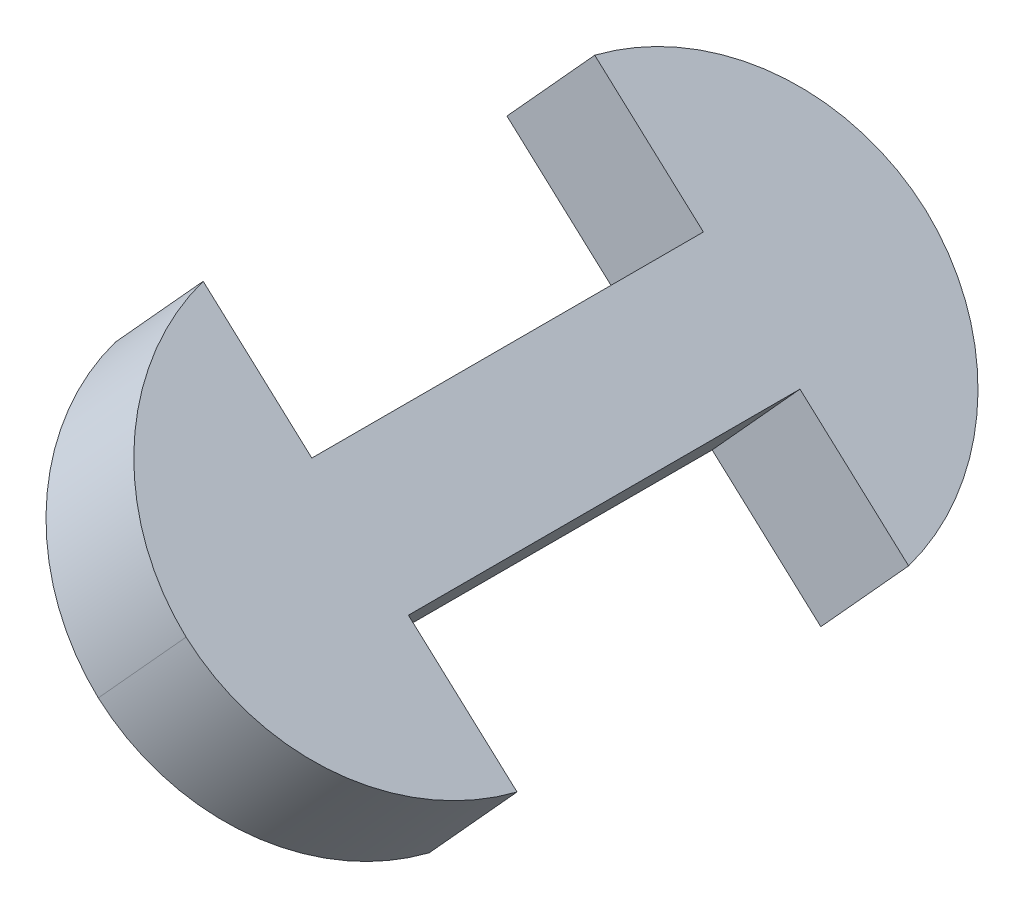
ISO-10303-21;
HEADER;
FILE_DESCRIPTION(('STEP AP214'),'2;1');
FILE_NAME('part.step','',(''),(''),'','','');
FILE_SCHEMA(('AUTOMOTIVE_DESIGN { 1 0 10303 214 1 1 1 1 }'));
ENDSEC;
DATA;
#1=APPLICATION_CONTEXT('core data for automotive mechanical design processes');
#2=APPLICATION_PROTOCOL_DEFINITION('international standard','automotive_design',2000,#1);
#3=PRODUCT_CONTEXT('',#1,'mechanical');
#4=PRODUCT('Part','Part','',(#3));
#5=PRODUCT_RELATED_PRODUCT_CATEGORY('part','',(#4));
#6=PRODUCT_DEFINITION_FORMATION('','',#4);
#7=PRODUCT_DEFINITION_CONTEXT('part definition',#1,'design');
#8=PRODUCT_DEFINITION('design','',#6,#7);
#9=PRODUCT_DEFINITION_SHAPE('','',#8);
#10=(LENGTH_UNIT() NAMED_UNIT(*) SI_UNIT(.MILLI.,.METRE.));
#11=(NAMED_UNIT(*) PLANE_ANGLE_UNIT() SI_UNIT($,.RADIAN.));
#12=(NAMED_UNIT(*) SI_UNIT($,.STERADIAN.) SOLID_ANGLE_UNIT());
#13=UNCERTAINTY_MEASURE_WITH_UNIT(LENGTH_MEASURE(1.E-05),#10,'distance_accuracy_value','');
#14=(GEOMETRIC_REPRESENTATION_CONTEXT(3) GLOBAL_UNCERTAINTY_ASSIGNED_CONTEXT((#13)) GLOBAL_UNIT_ASSIGNED_CONTEXT((#10,
#11,#12)) REPRESENTATION_CONTEXT('',''));
#15=CARTESIAN_POINT('',(0.,0.,0.));
#16=DIRECTION('',(0.,0.,1.));
#17=DIRECTION('',(1.,0.,0.));
#18=AXIS2_PLACEMENT_3D('',#15,#16,#17);
#19=CARTESIAN_POINT('',(0.,0.,0.));
#20=DIRECTION('',(0.,0.,1.));
#21=DIRECTION('',(1.,0.,0.));
#22=AXIS2_PLACEMENT_3D('',#19,#20,#21);
#23=PLANE('',#22);
#24=DIRECTION('',(0.672672793996317,0.73994007339594,0.));
#25=VECTOR('',#24,1.);
#26=CARTESIAN_POINT('',(-146.214037267714,11.5216889926446,0.));
#27=LINE('',#26,#25);
#28=CARTESIAN_POINT('',(-150.250074031691,7.08204855226896,0.));
#29=VERTEX_POINT('',#28);
#30=CARTESIAN_POINT('',(-146.214037267714,11.5216889926446,0.));
#31=VERTEX_POINT('',#30);
#32=EDGE_CURVE('E50',#29,#31,#27,.T.);
#33=ORIENTED_EDGE('',*,*,#32,.F.);
#34=DIRECTION('',(0.739940073395943,-0.672672793996314,0.));
#35=VECTOR('',#34,1.);
#36=CARTESIAN_POINT('',(-155.244669527114,11.6225899117438,0.));
#37=LINE('',#36,#35);
#38=CARTESIAN_POINT('',(-155.244669527114,11.6225899117438,0.));
#39=VERTEX_POINT('',#38);
#40=EDGE_CURVE('E225',#39,#29,#37,.T.);
#41=ORIENTED_EDGE('',*,*,#40,.F.);
#42=DIRECTION('',(-0.672672793996313,-0.739940073395943,0.));
#43=VECTOR('',#42,1.);
#44=CARTESIAN_POINT('',(-151.208632763136,16.0622303521195,0.));
#45=LINE('',#44,#43);
#46=CARTESIAN_POINT('',(-151.208632763136,16.0622303521195,0.));
#47=VERTEX_POINT('',#46);
#48=EDGE_CURVE('E211',#47,#39,#45,.T.);
#49=ORIENTED_EDGE('',*,*,#48,.F.);
#50=DIRECTION('',(-0.739940073395943,0.672672793996314,0.));
#51=VECTOR('',#50,1.);
#52=CARTESIAN_POINT('',(-136.779801331915,2.94511086919134,0.));
#53=LINE('',#52,#51);
#54=EDGE_CURVE('E55',#31,#47,#53,.T.);
#55=ORIENTED_EDGE('',*,*,#54,.F.);
#56=EDGE_LOOP('',(#33,#41,#49,#55));
#57=FACE_BOUND('',#56,.T.);
#58=ADVANCED_FACE('F33',(#57),#23,.F.);
#59=DIRECTION('',(-0.672672793996314,-0.739940073395942,0.));
#60=VECTOR('',#59,1.);
#61=CARTESIAN_POINT('',(-145.810433591316,3.04601178829107,0.));
#62=LINE('',#61,#60);
#63=CARTESIAN_POINT('',(-141.774396827338,7.48565222866671,0.));
#64=VERTEX_POINT('',#63);
#65=CARTESIAN_POINT('',(-145.810433591316,3.04601178829107,0.));
#66=VERTEX_POINT('',#65);
#67=EDGE_CURVE('E117',#64,#66,#62,.T.);
#68=ORIENTED_EDGE('',*,*,#67,.F.);
#69=CARTESIAN_POINT('',(-136.779801331915,2.94511086919134,0.));
#70=VERTEX_POINT('',#69);
#71=EDGE_CURVE('E194',#70,#64,#53,.T.);
#72=ORIENTED_EDGE('',*,*,#71,.F.);
#73=DIRECTION('',(0.672672793996318,0.739940073395939,0.));
#74=VECTOR('',#73,1.);
#75=CARTESIAN_POINT('',(-140.815838095893,-1.49452957118428,0.));
#76=LINE('',#75,#74);
#77=CARTESIAN_POINT('',(-140.815838095893,-1.49452957118428,0.));
#78=VERTEX_POINT('',#77);
#79=EDGE_CURVE('E223',#78,#70,#76,.T.);
#80=ORIENTED_EDGE('',*,*,#79,.F.);
#81=EDGE_CURVE('E229',#66,#78,#37,.T.);
#82=ORIENTED_EDGE('',*,*,#81,.F.);
#83=EDGE_LOOP('',(#68,#72,#80,#82));
#84=FACE_BOUND('',#83,.T.);
#85=ADVANCED_FACE('F238',(#84),#23,.F.);
#86=CARTESIAN_POINT('',(-136.779801331915,2.94511086919134,8.));
#87=DIRECTION('',(-0.672672793996313,-0.739940073395943,0.));
#88=DIRECTION('',(0.739940073395943,-0.672672793996314,0.));
#89=AXIS2_PLACEMENT_3D('',#86,#87,#88);
#90=PLANE('',#89);
#91=ORIENTED_EDGE('',*,*,#71,.T.);
#92=DIRECTION('',(0.,0.,1.));
#93=VECTOR('',#92,1.);
#94=CARTESIAN_POINT('',(-141.774396827338,7.48565222866671,-9.));
#95=LINE('',#94,#93);
#96=CARTESIAN_POINT('',(-141.774396827338,7.48565222866671,-18.));
#97=VERTEX_POINT('',#96);
#98=EDGE_CURVE('E119',#97,#64,#95,.T.);
#99=ORIENTED_EDGE('',*,*,#98,.F.);
#100=DIRECTION('',(-0.739940073395943,0.672672793996314,0.));
#101=VECTOR('',#100,1.);
#102=CARTESIAN_POINT('',(-136.779801331915,2.94511086919134,-18.));
#103=LINE('',#102,#101);
#104=CARTESIAN_POINT('',(-136.779801331915,2.94511086919134,-18.));
#105=VERTEX_POINT('',#104);
#106=EDGE_CURVE('E137',#105,#97,#103,.T.);
#107=ORIENTED_EDGE('',*,*,#106,.F.);
#108=CARTESIAN_POINT('',(-144.029703812145,9.53593130576443,-16.));
#109=DIRECTION('',(0.672672793996313,0.739940073395943,0.));
#110=DIRECTION('',(0.739940073395943,-0.672672793996314,0.));
#111=AXIS2_PLACEMENT_3D('',#108,#109,#110);
#112=CIRCLE('',#111,10.);
#113=CARTESIAN_POINT('',(-143.994217047526,9.5036706106554,-25.9998849961931));
#114=VERTEX_POINT('',#113);
#115=EDGE_CURVE('E162',#114,#105,#112,.F.);
#116=ORIENTED_EDGE('',*,*,#115,.F.);
#117=CARTESIAN_POINT('',(-143.958730282906,9.47140991554638,-16.));
#118=DIRECTION('',(0.672672793996313,0.739940073395943,0.));
#119=DIRECTION('',(0.739940073395943,-0.672672793996314,0.));
#120=AXIS2_PLACEMENT_3D('',#117,#118,#119);
#121=CIRCLE('',#120,10.);
#122=CARTESIAN_POINT('',(-151.208632763136,16.0622303521195,-18.));
#123=VERTEX_POINT('',#122);
#124=EDGE_CURVE('E159',#123,#114,#121,.F.);
#125=ORIENTED_EDGE('',*,*,#124,.F.);
#126=CARTESIAN_POINT('',(-146.214037267714,11.5216889926446,-18.));
#127=VERTEX_POINT('',#126);
#128=EDGE_CURVE('E155',#127,#123,#103,.T.);
#129=ORIENTED_EDGE('',*,*,#128,.F.);
#130=DIRECTION('',(0.,0.,1.));
#131=VECTOR('',#130,1.);
#132=CARTESIAN_POINT('',(-146.214037267714,11.5216889926446,-9.));
#133=LINE('',#132,#131);
#134=EDGE_CURVE('E182',#127,#31,#133,.T.);
#135=ORIENTED_EDGE('',*,*,#134,.T.);
#136=ORIENTED_EDGE('',*,*,#54,.T.);
#137=CARTESIAN_POINT('',(-143.958730282906,9.47140991554638,-2.));
#138=DIRECTION('',(-0.672672793996313,-0.739940073395943,0.));
#139=DIRECTION('',(0.739940073395943,-0.672672793996314,0.));
#140=AXIS2_PLACEMENT_3D('',#137,#138,#139);
#141=CIRCLE('',#140,10.);
#142=CARTESIAN_POINT('',(-143.994217047526,9.5036706106554,7.9998849961931));
#143=VERTEX_POINT('',#142);
#144=EDGE_CURVE('E11',#47,#143,#141,.F.);
#145=ORIENTED_EDGE('',*,*,#144,.T.);
#146=CARTESIAN_POINT('',(-144.029703812145,9.53593130576443,-2.));
#147=DIRECTION('',(-0.672672793996313,-0.739940073395943,0.));
#148=DIRECTION('',(0.739940073395943,-0.672672793996314,0.));
#149=AXIS2_PLACEMENT_3D('',#146,#147,#148);
#150=CIRCLE('',#149,10.);
#151=EDGE_CURVE('E42',#143,#70,#150,.F.);
#152=ORIENTED_EDGE('',*,*,#151,.T.);
#153=EDGE_LOOP('',(#91,#99,#107,#116,#125,#129,#135,#136,#145,#152));
#154=FACE_BOUND('',#153,.T.);
#155=ADVANCED_FACE('F187',(#154),#90,.F.);
#156=CARTESIAN_POINT('',(-155.244669527114,11.6225899117438,8.));
#157=DIRECTION('',(0.672672793996314,0.739940073395943,0.));
#158=DIRECTION('',(-0.739940073395943,0.672672793996314,0.));
#159=AXIS2_PLACEMENT_3D('',#156,#157,#158);
#160=PLANE('',#159);
#161=CARTESIAN_POINT('',(-148.065740576123,5.0962908653888,-2.));
#162=DIRECTION('',(0.672672793996314,0.739940073395943,0.));
#163=DIRECTION('',(-0.739940073395943,0.672672793996314,0.));
#164=AXIS2_PLACEMENT_3D('',#161,#162,#163);
#165=CIRCLE('',#164,10.);
#166=CARTESIAN_POINT('',(-148.030253811503,5.06403017027976,7.9998849961931));
#167=VERTEX_POINT('',#166);
#168=EDGE_CURVE('E221',#78,#167,#165,.F.);
#169=ORIENTED_EDGE('',*,*,#168,.T.);
#170=CARTESIAN_POINT('',(-147.994767046883,5.03176947517072,-2.));
#171=DIRECTION('',(0.672672793996314,0.739940073395943,0.));
#172=DIRECTION('',(-0.739940073395943,0.672672793996314,0.));
#173=AXIS2_PLACEMENT_3D('',#170,#171,#172);
#174=CIRCLE('',#173,10.);
#175=EDGE_CURVE('E219',#167,#39,#174,.F.);
#176=ORIENTED_EDGE('',*,*,#175,.T.);
#177=ORIENTED_EDGE('',*,*,#40,.T.);
#178=DIRECTION('',(0.,0.,1.));
#179=VECTOR('',#178,1.);
#180=CARTESIAN_POINT('',(-150.250074031691,7.08204855226896,-9.));
#181=LINE('',#180,#179);
#182=CARTESIAN_POINT('',(-150.250074031691,7.08204855226896,-18.));
#183=VERTEX_POINT('',#182);
#184=EDGE_CURVE('E120',#183,#29,#181,.T.);
#185=ORIENTED_EDGE('',*,*,#184,.F.);
#186=DIRECTION('',(0.739940073395943,-0.672672793996314,0.));
#187=VECTOR('',#186,1.);
#188=CARTESIAN_POINT('',(-155.244669527114,11.6225899117438,-18.));
#189=LINE('',#188,#187);
#190=CARTESIAN_POINT('',(-155.244669527114,11.6225899117438,-18.));
#191=VERTEX_POINT('',#190);
#192=EDGE_CURVE('E131',#191,#183,#189,.T.);
#193=ORIENTED_EDGE('',*,*,#192,.F.);
#194=CARTESIAN_POINT('',(-147.994767046883,5.03176947517072,-16.));
#195=DIRECTION('',(-0.672672793996314,-0.739940073395943,0.));
#196=DIRECTION('',(-0.739940073395943,0.672672793996314,0.));
#197=AXIS2_PLACEMENT_3D('',#194,#195,#196);
#198=CIRCLE('',#197,10.);
#199=CARTESIAN_POINT('',(-148.030253811503,5.06403017027976,-25.9998849961931));
#200=VERTEX_POINT('',#199);
#201=EDGE_CURVE('E164',#200,#191,#198,.F.);
#202=ORIENTED_EDGE('',*,*,#201,.F.);
#203=CARTESIAN_POINT('',(-148.065740576123,5.0962908653888,-16.));
#204=DIRECTION('',(-0.672672793996314,-0.739940073395943,0.));
#205=DIRECTION('',(-0.739940073395943,0.672672793996314,0.));
#206=AXIS2_PLACEMENT_3D('',#203,#204,#205);
#207=CIRCLE('',#206,10.);
#208=CARTESIAN_POINT('',(-140.815838095893,-1.49452957118428,-18.));
#209=VERTEX_POINT('',#208);
#210=EDGE_CURVE('E127',#209,#200,#207,.F.);
#211=ORIENTED_EDGE('',*,*,#210,.F.);
#212=CARTESIAN_POINT('',(-145.810433591316,3.04601178829107,-18.));
#213=VERTEX_POINT('',#212);
#214=EDGE_CURVE('E123',#213,#209,#189,.T.);
#215=ORIENTED_EDGE('',*,*,#214,.F.);
#216=DIRECTION('',(0.,0.,1.));
#217=VECTOR('',#216,1.);
#218=CARTESIAN_POINT('',(-145.810433591316,3.04601178829107,-9.));
#219=LINE('',#218,#217);
#220=EDGE_CURVE('E111',#213,#66,#219,.T.);
#221=ORIENTED_EDGE('',*,*,#220,.T.);
#222=ORIENTED_EDGE('',*,*,#81,.T.);
#223=EDGE_LOOP('',(#169,#176,#177,#185,#193,#202,#211,#215,#221,#222));
#224=FACE_BOUND('',#223,.T.);
#225=ADVANCED_FACE('F124',(#224),#160,.F.);
#226=CARTESIAN_POINT('',(-148.065740576123,5.09629086538885,-2.));
#227=DIRECTION('',(0.672672793996318,0.739940073395939,0.));
#228=DIRECTION('',(-0.739940073395939,0.672672793996318,0.));
#229=AXIS2_PLACEMENT_3D('',#226,#227,#228);
#230=CYLINDRICAL_SURFACE('',#229,10.);
#231=ORIENTED_EDGE('',*,*,#79,.T.);
#232=ORIENTED_EDGE('',*,*,#151,.F.);
#233=DIRECTION('',(0.672672793996318,0.739940073395939,0.));
#234=VECTOR('',#233,1.);
#235=CARTESIAN_POINT('',(-146.012235429514,7.28385039046759,7.9998849961931));
#236=LINE('',#235,#234);
#237=EDGE_CURVE('E195',#167,#143,#236,.T.);
#238=ORIENTED_EDGE('',*,*,#237,.F.);
#239=ORIENTED_EDGE('',*,*,#168,.F.);
#240=EDGE_LOOP('',(#231,#232,#238,#239));
#241=FACE_BOUND('',#240,.T.);
#242=ADVANCED_FACE('F35',(#241),#230,.T.);
#243=CARTESIAN_POINT('',(-143.958730282906,9.47140991554638,-2.));
#244=DIRECTION('',(-0.672672793996313,-0.739940073395943,0.));
#245=DIRECTION('',(0.739940073395943,-0.672672793996313,0.));
#246=AXIS2_PLACEMENT_3D('',#243,#244,#245);
#247=CYLINDRICAL_SURFACE('',#246,10.);
#248=ORIENTED_EDGE('',*,*,#144,.F.);
#249=ORIENTED_EDGE('',*,*,#48,.T.);
#250=ORIENTED_EDGE('',*,*,#175,.F.);
#251=ORIENTED_EDGE('',*,*,#237,.T.);
#252=EDGE_LOOP('',(#248,#249,#250,#251));
#253=FACE_BOUND('',#252,.T.);
#254=ADVANCED_FACE('F236',(#253),#247,.T.);
#255=CARTESIAN_POINT('',(-145.810433591316,3.04601178829107,-9.));
#256=DIRECTION('',(-0.739940073395942,0.672672793996314,0.));
#257=DIRECTION('',(-0.672672793996314,-0.739940073395942,0.));
#258=AXIS2_PLACEMENT_3D('',#255,#256,#257);
#259=PLANE('',#258);
#260=ORIENTED_EDGE('',*,*,#67,.T.);
#261=ORIENTED_EDGE('',*,*,#220,.F.);
#262=DIRECTION('',(-0.672672793996314,-0.739940073395942,0.));
#263=VECTOR('',#262,1.);
#264=CARTESIAN_POINT('',(-145.810433591316,3.04601178829107,-18.));
#265=LINE('',#264,#263);
#266=EDGE_CURVE('E116',#97,#213,#265,.T.);
#267=ORIENTED_EDGE('',*,*,#266,.F.);
#268=ORIENTED_EDGE('',*,*,#98,.T.);
#269=EDGE_LOOP('',(#260,#261,#267,#268));
#270=FACE_BOUND('',#269,.T.);
#271=ADVANCED_FACE('F113',(#270),#259,.F.);
#272=CARTESIAN_POINT('',(-146.214037267714,11.5216889926446,-9.));
#273=DIRECTION('',(0.73994007339594,-0.672672793996317,0.));
#274=DIRECTION('',(0.672672793996317,0.73994007339594,0.));
#275=AXIS2_PLACEMENT_3D('',#272,#273,#274);
#276=PLANE('',#275);
#277=ORIENTED_EDGE('',*,*,#32,.T.);
#278=ORIENTED_EDGE('',*,*,#134,.F.);
#279=DIRECTION('',(0.672672793996317,0.73994007339594,0.));
#280=VECTOR('',#279,1.);
#281=CARTESIAN_POINT('',(-146.214037267714,11.5216889926446,-18.));
#282=LINE('',#281,#280);
#283=EDGE_CURVE('E138',#183,#127,#282,.T.);
#284=ORIENTED_EDGE('',*,*,#283,.F.);
#285=ORIENTED_EDGE('',*,*,#184,.T.);
#286=EDGE_LOOP('',(#277,#278,#284,#285));
#287=FACE_BOUND('',#286,.T.);
#288=ADVANCED_FACE('F180',(#287),#276,.F.);
#289=CARTESIAN_POINT('',(0.,0.,-18.));
#290=DIRECTION('',(0.,0.,-1.));
#291=DIRECTION('',(1.,0.,0.));
#292=AXIS2_PLACEMENT_3D('',#289,#290,#291);
#293=PLANE('',#292);
#294=ORIENTED_EDGE('',*,*,#283,.T.);
#295=ORIENTED_EDGE('',*,*,#128,.T.);
#296=DIRECTION('',(-0.672672793996313,-0.739940073395943,0.));
#297=VECTOR('',#296,1.);
#298=CARTESIAN_POINT('',(-151.208632763136,16.0622303521195,-18.));
#299=LINE('',#298,#297);
#300=EDGE_CURVE('E132',#123,#191,#299,.T.);
#301=ORIENTED_EDGE('',*,*,#300,.T.);
#302=ORIENTED_EDGE('',*,*,#192,.T.);
#303=EDGE_LOOP('',(#294,#295,#301,#302));
#304=FACE_BOUND('',#303,.T.);
#305=ADVANCED_FACE('F175',(#304),#293,.F.);
#306=ORIENTED_EDGE('',*,*,#266,.T.);
#307=ORIENTED_EDGE('',*,*,#214,.T.);
#308=DIRECTION('',(0.672672793996318,0.739940073395939,0.));
#309=VECTOR('',#308,1.);
#310=CARTESIAN_POINT('',(-140.815838095893,-1.49452957118428,-18.));
#311=LINE('',#310,#309);
#312=EDGE_CURVE('E167',#209,#105,#311,.T.);
#313=ORIENTED_EDGE('',*,*,#312,.T.);
#314=ORIENTED_EDGE('',*,*,#106,.T.);
#315=EDGE_LOOP('',(#306,#307,#313,#314));
#316=FACE_BOUND('',#315,.T.);
#317=ADVANCED_FACE('F135',(#316),#293,.F.);
#318=CARTESIAN_POINT('',(-148.065740576123,5.09629086538885,-16.));
#319=DIRECTION('',(0.672672793996318,0.739940073395939,0.));
#320=DIRECTION('',(-0.739940073395939,0.672672793996318,0.));
#321=AXIS2_PLACEMENT_3D('',#318,#319,#320);
#322=CYLINDRICAL_SURFACE('',#321,10.);
#323=ORIENTED_EDGE('',*,*,#312,.F.);
#324=ORIENTED_EDGE('',*,*,#210,.T.);
#325=DIRECTION('',(0.672672793996318,0.739940073395939,0.));
#326=VECTOR('',#325,1.);
#327=CARTESIAN_POINT('',(-146.012235429514,7.28385039046759,-25.9998849961931));
#328=LINE('',#327,#326);
#329=EDGE_CURVE('E141',#200,#114,#328,.T.);
#330=ORIENTED_EDGE('',*,*,#329,.T.);
#331=ORIENTED_EDGE('',*,*,#115,.T.);
#332=EDGE_LOOP('',(#323,#324,#330,#331));
#333=FACE_BOUND('',#332,.T.);
#334=ADVANCED_FACE('F192',(#333),#322,.T.);
#335=CARTESIAN_POINT('',(-143.958730282906,9.47140991554638,-16.));
#336=DIRECTION('',(-0.672672793996313,-0.739940073395943,0.));
#337=DIRECTION('',(0.739940073395943,-0.672672793996313,0.));
#338=AXIS2_PLACEMENT_3D('',#335,#336,#337);
#339=CYLINDRICAL_SURFACE('',#338,10.);
#340=ORIENTED_EDGE('',*,*,#124,.T.);
#341=ORIENTED_EDGE('',*,*,#329,.F.);
#342=ORIENTED_EDGE('',*,*,#201,.T.);
#343=ORIENTED_EDGE('',*,*,#300,.F.);
#344=EDGE_LOOP('',(#340,#341,#342,#343));
#345=FACE_BOUND('',#344,.T.);
#346=ADVANCED_FACE('F190',(#345),#339,.T.);
#347=CLOSED_SHELL('',(#58,#85,#155,#225,#242,#254,#271,#288,#305,#317,#334,#346));
#348=MANIFOLD_SOLID_BREP('B2',#347);
#349=ADVANCED_BREP_SHAPE_REPRESENTATION('',(#18,#348),#14);
#350=SHAPE_DEFINITION_REPRESENTATION(#9,#349);
ENDSEC;
END-ISO-10303-21;
